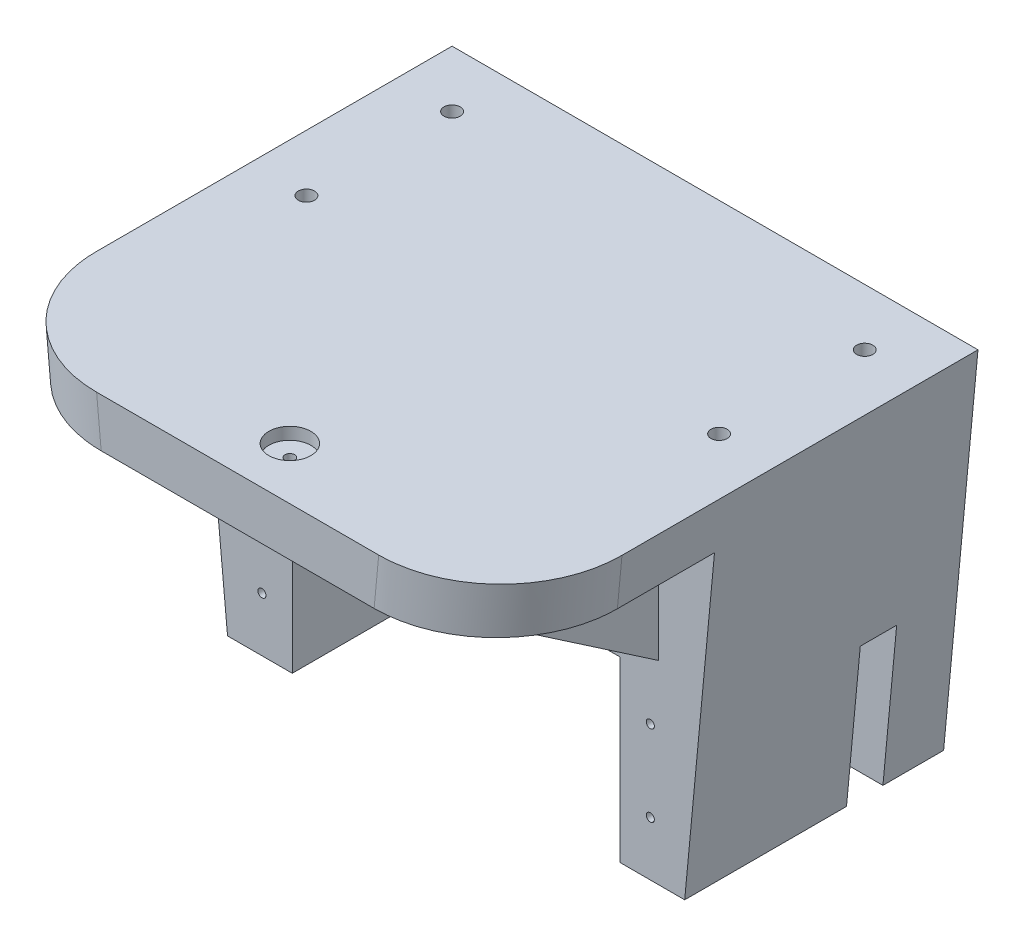
ISO-10303-21;
HEADER;
FILE_DESCRIPTION(('STEP AP214'),'2;1');
FILE_NAME('part.step','',(''),(''),'','','');
FILE_SCHEMA(('AUTOMOTIVE_DESIGN { 1 0 10303 214 1 1 1 1 }'));
ENDSEC;
DATA;
#1=APPLICATION_CONTEXT('core data for automotive mechanical design processes');
#2=APPLICATION_PROTOCOL_DEFINITION('international standard','automotive_design',2000,#1);
#3=PRODUCT_CONTEXT('',#1,'mechanical');
#4=PRODUCT('Part','Part','',(#3));
#5=PRODUCT_RELATED_PRODUCT_CATEGORY('part','',(#4));
#6=PRODUCT_DEFINITION_FORMATION('','',#4);
#7=PRODUCT_DEFINITION_CONTEXT('part definition',#1,'design');
#8=PRODUCT_DEFINITION('design','',#6,#7);
#9=PRODUCT_DEFINITION_SHAPE('','',#8);
#10=(LENGTH_UNIT() NAMED_UNIT(*) SI_UNIT(.MILLI.,.METRE.));
#11=(NAMED_UNIT(*) PLANE_ANGLE_UNIT() SI_UNIT($,.RADIAN.));
#12=(NAMED_UNIT(*) SI_UNIT($,.STERADIAN.) SOLID_ANGLE_UNIT());
#13=UNCERTAINTY_MEASURE_WITH_UNIT(LENGTH_MEASURE(1.E-05),#10,'distance_accuracy_value','');
#14=(GEOMETRIC_REPRESENTATION_CONTEXT(3) GLOBAL_UNCERTAINTY_ASSIGNED_CONTEXT((#13)) GLOBAL_UNIT_ASSIGNED_CONTEXT((#10,
#11,#12)) REPRESENTATION_CONTEXT('',''));
#15=CARTESIAN_POINT('',(0.,0.,0.));
#16=DIRECTION('',(0.,0.,1.));
#17=DIRECTION('',(1.,0.,0.));
#18=AXIS2_PLACEMENT_3D('',#15,#16,#17);
#19=CARTESIAN_POINT('',(0.,0.,30.));
#20=DIRECTION('',(0.,0.,-1.));
#21=DIRECTION('',(-1.,0.,0.));
#22=AXIS2_PLACEMENT_3D('',#19,#20,#21);
#23=PLANE('',#22);
#24=CARTESIAN_POINT('',(-24.,3.01948180668569,30.));
#25=DIRECTION('',(0.,0.,1.));
#26=DIRECTION('',(1.,0.,0.));
#27=AXIS2_PLACEMENT_3D('',#24,#25,#26);
#28=CIRCLE('',#27,0.499999999999999);
#29=CARTESIAN_POINT('',(-23.5,3.01948180668569,30.));
#30=VERTEX_POINT('',#29);
#31=EDGE_CURVE('E308',#30,#30,#28,.T.);
#32=ORIENTED_EDGE('',*,*,#31,.F.);
#33=EDGE_LOOP('',(#32));
#34=FACE_BOUND('',#33,.T.);
#35=CARTESIAN_POINT('',(24.,-6.98051819331431,30.));
#36=DIRECTION('',(0.,0.,1.));
#37=DIRECTION('',(1.,0.,0.));
#38=AXIS2_PLACEMENT_3D('',#35,#36,#37);
#39=CIRCLE('',#38,0.499999999999999);
#40=CARTESIAN_POINT('',(24.5,-6.98051819331431,30.));
#41=VERTEX_POINT('',#40);
#42=EDGE_CURVE('E296',#41,#41,#39,.T.);
#43=ORIENTED_EDGE('',*,*,#42,.F.);
#44=EDGE_LOOP('',(#43));
#45=FACE_BOUND('',#44,.T.);
#46=CARTESIAN_POINT('',(-24.,-6.98051819331431,30.));
#47=DIRECTION('',(0.,0.,1.));
#48=DIRECTION('',(1.,0.,0.));
#49=AXIS2_PLACEMENT_3D('',#46,#47,#48);
#50=CIRCLE('',#49,0.499999999999999);
#51=CARTESIAN_POINT('',(-23.5,-6.98051819331431,30.));
#52=VERTEX_POINT('',#51);
#53=EDGE_CURVE('E313',#52,#52,#50,.T.);
#54=ORIENTED_EDGE('',*,*,#53,.F.);
#55=EDGE_LOOP('',(#54));
#56=FACE_BOUND('',#55,.T.);
#57=CARTESIAN_POINT('',(24.,3.01948180668569,30.));
#58=DIRECTION('',(0.,0.,1.));
#59=DIRECTION('',(1.,0.,0.));
#60=AXIS2_PLACEMENT_3D('',#57,#58,#59);
#61=CIRCLE('',#60,0.499999999999999);
#62=CARTESIAN_POINT('',(24.5,3.01948180668569,30.));
#63=VERTEX_POINT('',#62);
#64=EDGE_CURVE('E304',#63,#63,#61,.T.);
#65=ORIENTED_EDGE('',*,*,#64,.F.);
#66=EDGE_LOOP('',(#65));
#67=FACE_BOUND('',#66,.T.);
#68=DIRECTION('',(0.,1.,0.));
#69=VECTOR('',#68,1.);
#70=CARTESIAN_POINT('',(-25.,25.3194818066857,30.));
#71=LINE('',#70,#69);
#72=CARTESIAN_POINT('',(-25.,10.3194818066857,30.));
#73=VERTEX_POINT('',#72);
#74=CARTESIAN_POINT('',(-25.,25.3194818066857,30.));
#75=VERTEX_POINT('',#74);
#76=EDGE_CURVE('E199',#73,#75,#71,.T.);
#77=ORIENTED_EDGE('',*,*,#76,.T.);
#78=DIRECTION('',(1.,0.,0.));
#79=VECTOR('',#78,1.);
#80=CARTESIAN_POINT('',(31.9333333333333,25.3194818066857,30.));
#81=LINE('',#80,#79);
#82=CARTESIAN_POINT('',(-31.9333333333333,25.3194818066857,30.));
#83=VERTEX_POINT('',#82);
#84=EDGE_CURVE('E211',#83,#75,#81,.T.);
#85=ORIENTED_EDGE('',*,*,#84,.F.);
#86=DIRECTION('',(0.0940260309196416,-0.995569739149146,0.));
#87=VECTOR('',#86,1.);
#88=CARTESIAN_POINT('',(-28.25,-13.6805181933143,30.));
#89=LINE('',#88,#87);
#90=CARTESIAN_POINT('',(-28.25,-13.6805181933143,30.));
#91=VERTEX_POINT('',#90);
#92=EDGE_CURVE('E375',#83,#91,#89,.T.);
#93=ORIENTED_EDGE('',*,*,#92,.T.);
#94=DIRECTION('',(1.,0.,0.));
#95=VECTOR('',#94,1.);
#96=CARTESIAN_POINT('',(-20.25,-13.6805181933143,30.));
#97=LINE('',#96,#95);
#98=CARTESIAN_POINT('',(-20.25,-13.6805181933143,30.));
#99=VERTEX_POINT('',#98);
#100=EDGE_CURVE('E378',#91,#99,#97,.T.);
#101=ORIENTED_EDGE('',*,*,#100,.T.);
#102=DIRECTION('',(0.,1.,0.));
#103=VECTOR('',#102,1.);
#104=CARTESIAN_POINT('',(-20.25,8.31948180668569,30.));
#105=LINE('',#104,#103);
#106=CARTESIAN_POINT('',(-20.25,8.31948180668569,30.));
#107=VERTEX_POINT('',#106);
#108=EDGE_CURVE('E382',#99,#107,#105,.T.);
#109=ORIENTED_EDGE('',*,*,#108,.T.);
#110=DIRECTION('',(1.,0.,0.));
#111=VECTOR('',#110,1.);
#112=CARTESIAN_POINT('',(20.25,8.31948180668569,30.));
#113=LINE('',#112,#111);
#114=CARTESIAN_POINT('',(20.25,8.31948180668569,30.));
#115=VERTEX_POINT('',#114);
#116=EDGE_CURVE('E385',#107,#115,#113,.T.);
#117=ORIENTED_EDGE('',*,*,#116,.T.);
#118=DIRECTION('',(0.,-1.,0.));
#119=VECTOR('',#118,1.);
#120=CARTESIAN_POINT('',(20.25,-13.6805181933143,30.));
#121=LINE('',#120,#119);
#122=CARTESIAN_POINT('',(20.25,-13.6805181933143,30.));
#123=VERTEX_POINT('',#122);
#124=EDGE_CURVE('E388',#115,#123,#121,.T.);
#125=ORIENTED_EDGE('',*,*,#124,.T.);
#126=DIRECTION('',(1.,0.,0.));
#127=VECTOR('',#126,1.);
#128=CARTESIAN_POINT('',(28.25,-13.6805181933143,30.));
#129=LINE('',#128,#127);
#130=CARTESIAN_POINT('',(28.25,-13.6805181933143,30.));
#131=VERTEX_POINT('',#130);
#132=EDGE_CURVE('E391',#123,#131,#129,.T.);
#133=ORIENTED_EDGE('',*,*,#132,.T.);
#134=DIRECTION('',(0.0940260309196416,0.995569739149146,0.));
#135=VECTOR('',#134,1.);
#136=CARTESIAN_POINT('',(32.5,31.3194818066857,30.));
#137=LINE('',#136,#135);
#138=CARTESIAN_POINT('',(31.9333333333333,25.3194818066857,30.));
#139=VERTEX_POINT('',#138);
#140=EDGE_CURVE('E394',#131,#139,#137,.T.);
#141=ORIENTED_EDGE('',*,*,#140,.T.);
#142=CARTESIAN_POINT('',(25.,25.3194818066857,30.));
#143=VERTEX_POINT('',#142);
#144=EDGE_CURVE('E224',#143,#139,#81,.T.);
#145=ORIENTED_EDGE('',*,*,#144,.F.);
#146=DIRECTION('',(0.,1.,0.));
#147=VECTOR('',#146,1.);
#148=CARTESIAN_POINT('',(25.,25.3194818066857,30.));
#149=LINE('',#148,#147);
#150=CARTESIAN_POINT('',(25.,10.3194818066857,30.));
#151=VERTEX_POINT('',#150);
#152=EDGE_CURVE('E247',#151,#143,#149,.T.);
#153=ORIENTED_EDGE('',*,*,#152,.F.);
#154=DIRECTION('',(-1.,0.,0.));
#155=VECTOR('',#154,1.);
#156=CARTESIAN_POINT('',(25.,10.3194818066857,30.));
#157=LINE('',#156,#155);
#158=CARTESIAN_POINT('',(20.,10.3194818066857,30.));
#159=VERTEX_POINT('',#158);
#160=EDGE_CURVE('E240',#151,#159,#157,.T.);
#161=ORIENTED_EDGE('',*,*,#160,.T.);
#162=DIRECTION('',(0.,1.,0.));
#163=VECTOR('',#162,1.);
#164=CARTESIAN_POINT('',(20.,25.3194818066857,30.));
#165=LINE('',#164,#163);
#166=CARTESIAN_POINT('',(20.,25.3194818066857,30.));
#167=VERTEX_POINT('',#166);
#168=EDGE_CURVE('E1089',#159,#167,#165,.T.);
#169=ORIENTED_EDGE('',*,*,#168,.T.);
#170=CARTESIAN_POINT('',(-20.,25.3194818066857,30.));
#171=VERTEX_POINT('',#170);
#172=EDGE_CURVE('E222',#171,#167,#81,.T.);
#173=ORIENTED_EDGE('',*,*,#172,.F.);
#174=DIRECTION('',(0.,1.,0.));
#175=VECTOR('',#174,1.);
#176=CARTESIAN_POINT('',(-20.,25.3194818066857,30.));
#177=LINE('',#176,#175);
#178=CARTESIAN_POINT('',(-20.,10.3194818066857,30.));
#179=VERTEX_POINT('',#178);
#180=EDGE_CURVE('E1065',#179,#171,#177,.T.);
#181=ORIENTED_EDGE('',*,*,#180,.F.);
#182=DIRECTION('',(1.,0.,0.));
#183=VECTOR('',#182,1.);
#184=CARTESIAN_POINT('',(-25.,10.3194818066857,30.));
#185=LINE('',#184,#183);
#186=EDGE_CURVE('E214',#73,#179,#185,.T.);
#187=ORIENTED_EDGE('',*,*,#186,.F.);
#188=EDGE_LOOP('',(#77,#85,#93,#101,#109,#117,#125,#133,#141,#145,#153,#161,#169,#173,#181,#187));
#189=FACE_BOUND('',#188,.T.);
#190=ADVANCED_FACE('F44',(#34,#45,#56,#67,#189),#23,.F.);
#191=CARTESIAN_POINT('',(31.9333333333333,25.3194818066857,57.));
#192=DIRECTION('',(0.,1.,0.));
#193=DIRECTION('',(-1.,0.,0.));
#194=AXIS2_PLACEMENT_3D('',#191,#192,#193);
#195=PLANE('',#194);
#196=CARTESIAN_POINT('',(0.,25.3194818066857,50.55));
#197=DIRECTION('',(0.,1.,0.));
#198=DIRECTION('',(-1.,0.,0.));
#199=AXIS2_PLACEMENT_3D('',#196,#197,#198);
#200=CIRCLE('',#199,1.1);
#201=CARTESIAN_POINT('',(-1.1,25.3194818066857,50.55));
#202=VERTEX_POINT('',#201);
#203=EDGE_CURVE('E54',#202,#202,#200,.T.);
#204=ORIENTED_EDGE('',*,*,#203,.T.);
#205=EDGE_LOOP('',(#204));
#206=FACE_BOUND('',#205,.T.);
#207=DIRECTION('',(1.,0.,0.));
#208=VECTOR('',#207,1.);
#209=CARTESIAN_POINT('',(31.9333333333333,25.3194818066857,57.));
#210=LINE('',#209,#208);
#211=CARTESIAN_POINT('',(-16.8665837022933,25.3194818066857,57.));
#212=VERTEX_POINT('',#211);
#213=CARTESIAN_POINT('',(16.8665837022933,25.3194818066857,57.));
#214=VERTEX_POINT('',#213);
#215=EDGE_CURVE('E221',#212,#214,#210,.T.);
#216=ORIENTED_EDGE('',*,*,#215,.F.);
#217=CARTESIAN_POINT('',(-16.8665837022933,25.3194818066857,42.));
#218=DIRECTION('',(0.,1.,0.));
#219=DIRECTION('',(1.,0.,0.));
#220=AXIS2_PLACEMENT_3D('',#217,#218,#219);
#221=ELLIPSE('',#220,15.06674963104,15.);
#222=CARTESIAN_POINT('',(-31.9333333333333,25.3194818066857,42.));
#223=VERTEX_POINT('',#222);
#224=EDGE_CURVE('E459',#212,#223,#221,.F.);
#225=ORIENTED_EDGE('',*,*,#224,.T.);
#226=DIRECTION('',(0.,0.,-1.));
#227=VECTOR('',#226,1.);
#228=CARTESIAN_POINT('',(-31.9333333333333,25.3194818066857,57.));
#229=LINE('',#228,#227);
#230=EDGE_CURVE('E219',#223,#83,#229,.T.);
#231=ORIENTED_EDGE('',*,*,#230,.T.);
#232=ORIENTED_EDGE('',*,*,#84,.T.);
#233=DIRECTION('',(0.,0.,1.));
#234=VECTOR('',#233,1.);
#235=CARTESIAN_POINT('',(-25.,25.3194818066857,52.));
#236=LINE('',#235,#234);
#237=CARTESIAN_POINT('',(-25.,25.3194818066857,52.));
#238=VERTEX_POINT('',#237);
#239=EDGE_CURVE('E196',#75,#238,#236,.T.);
#240=ORIENTED_EDGE('',*,*,#239,.T.);
#241=DIRECTION('',(1.,0.,0.));
#242=VECTOR('',#241,1.);
#243=CARTESIAN_POINT('',(-25.,25.3194818066857,52.));
#244=LINE('',#243,#242);
#245=CARTESIAN_POINT('',(-20.,25.3194818066857,52.));
#246=VERTEX_POINT('',#245);
#247=EDGE_CURVE('E1072',#238,#246,#244,.T.);
#248=ORIENTED_EDGE('',*,*,#247,.T.);
#249=DIRECTION('',(0.,0.,1.));
#250=VECTOR('',#249,1.);
#251=CARTESIAN_POINT('',(-20.,25.3194818066857,52.));
#252=LINE('',#251,#250);
#253=EDGE_CURVE('E1060',#171,#246,#252,.T.);
#254=ORIENTED_EDGE('',*,*,#253,.F.);
#255=ORIENTED_EDGE('',*,*,#172,.T.);
#256=DIRECTION('',(0.,0.,1.));
#257=VECTOR('',#256,1.);
#258=CARTESIAN_POINT('',(20.,25.3194818066857,52.));
#259=LINE('',#258,#257);
#260=CARTESIAN_POINT('',(20.,25.3194818066857,52.));
#261=VERTEX_POINT('',#260);
#262=EDGE_CURVE('E1083',#167,#261,#259,.T.);
#263=ORIENTED_EDGE('',*,*,#262,.T.);
#264=DIRECTION('',(-1.,0.,0.));
#265=VECTOR('',#264,1.);
#266=CARTESIAN_POINT('',(25.,25.3194818066857,52.));
#267=LINE('',#266,#265);
#268=CARTESIAN_POINT('',(25.,25.3194818066857,52.));
#269=VERTEX_POINT('',#268);
#270=EDGE_CURVE('E234',#269,#261,#267,.T.);
#271=ORIENTED_EDGE('',*,*,#270,.F.);
#272=DIRECTION('',(0.,0.,1.));
#273=VECTOR('',#272,1.);
#274=CARTESIAN_POINT('',(25.,25.3194818066857,52.));
#275=LINE('',#274,#273);
#276=EDGE_CURVE('E1084',#143,#269,#275,.T.);
#277=ORIENTED_EDGE('',*,*,#276,.F.);
#278=ORIENTED_EDGE('',*,*,#144,.T.);
#279=DIRECTION('',(0.,0.,-1.));
#280=VECTOR('',#279,1.);
#281=CARTESIAN_POINT('',(31.9333333333333,25.3194818066857,57.));
#282=LINE('',#281,#280);
#283=CARTESIAN_POINT('',(31.9333333333333,25.3194818066857,42.));
#284=VERTEX_POINT('',#283);
#285=EDGE_CURVE('E252',#284,#139,#282,.T.);
#286=ORIENTED_EDGE('',*,*,#285,.F.);
#287=CARTESIAN_POINT('',(16.8665837022933,25.3194818066857,42.));
#288=DIRECTION('',(0.,1.,0.));
#289=DIRECTION('',(1.,0.,0.));
#290=AXIS2_PLACEMENT_3D('',#287,#288,#289);
#291=ELLIPSE('',#290,15.06674963104,15.);
#292=EDGE_CURVE('E456',#284,#214,#291,.F.);
#293=ORIENTED_EDGE('',*,*,#292,.T.);
#294=EDGE_LOOP('',(#216,#225,#231,#232,#240,#248,#254,#255,#263,#271,#277,#278,#286,#293));
#295=FACE_BOUND('',#294,.T.);
#296=ADVANCED_FACE('F218',(#206,#295),#195,.F.);
#297=CARTESIAN_POINT('',(28.25,-13.6805181933143,30.));
#298=DIRECTION('',(0.,1.,0.));
#299=DIRECTION('',(0.,0.,1.));
#300=AXIS2_PLACEMENT_3D('',#297,#298,#299);
#301=PLANE('',#300);
#302=DIRECTION('',(0.,0.,-1.));
#303=VECTOR('',#302,1.);
#304=CARTESIAN_POINT('',(20.25,-13.6805181933143,30.));
#305=LINE('',#304,#303);
#306=CARTESIAN_POINT('',(20.25,-13.6805181933143,10.));
#307=VERTEX_POINT('',#306);
#308=EDGE_CURVE('E419',#123,#307,#305,.T.);
#309=ORIENTED_EDGE('',*,*,#308,.T.);
#310=DIRECTION('',(1.,0.,0.));
#311=VECTOR('',#310,1.);
#312=CARTESIAN_POINT('',(11.5,-13.6805181933143,10.));
#313=LINE('',#312,#311);
#314=CARTESIAN_POINT('',(28.25,-13.6805181933143,10.));
#315=VERTEX_POINT('',#314);
#316=EDGE_CURVE('E348',#307,#315,#313,.T.);
#317=ORIENTED_EDGE('',*,*,#316,.T.);
#318=DIRECTION('',(0.,0.,-1.));
#319=VECTOR('',#318,1.);
#320=CARTESIAN_POINT('',(28.25,-13.6805181933143,30.));
#321=LINE('',#320,#319);
#322=EDGE_CURVE('E414',#131,#315,#321,.T.);
#323=ORIENTED_EDGE('',*,*,#322,.F.);
#324=ORIENTED_EDGE('',*,*,#132,.F.);
#325=EDGE_LOOP('',(#309,#317,#323,#324));
#326=FACE_BOUND('',#325,.T.);
#327=ADVANCED_FACE('F492',(#326),#301,.F.);
#328=CARTESIAN_POINT('',(-28.25,-13.6805181933143,30.));
#329=DIRECTION('',(0.995569739149146,0.0940260309196416,0.));
#330=DIRECTION('',(-0.0940260309196416,0.995569739149146,0.));
#331=AXIS2_PLACEMENT_3D('',#328,#329,#330);
#332=PLANE('',#331);
#333=ORIENTED_EDGE('',*,*,#230,.F.);
#334=DIRECTION('',(0.0940260309196416,-0.995569739149146,0.));
#335=VECTOR('',#334,1.);
#336=CARTESIAN_POINT('',(-28.25,-13.6805181933143,42.));
#337=LINE('',#336,#335);
#338=CARTESIAN_POINT('',(-32.5,31.3194818066857,42.));
#339=VERTEX_POINT('',#338);
#340=EDGE_CURVE('E69',#223,#339,#337,.F.);
#341=ORIENTED_EDGE('',*,*,#340,.T.);
#342=DIRECTION('',(0.,0.,-1.));
#343=VECTOR('',#342,1.);
#344=CARTESIAN_POINT('',(-32.5,31.3194818066857,30.));
#345=LINE('',#344,#343);
#346=CARTESIAN_POINT('',(-32.5,31.3194818066857,-2.));
#347=VERTEX_POINT('',#346);
#348=EDGE_CURVE('E397',#339,#347,#345,.T.);
#349=ORIENTED_EDGE('',*,*,#348,.T.);
#350=DIRECTION('',(-0.0940260309196416,0.995569739149146,0.));
#351=VECTOR('',#350,1.);
#352=CARTESIAN_POINT('',(-32.5,31.3194818066857,-2.));
#353=LINE('',#352,#351);
#354=CARTESIAN_POINT('',(-28.25,-13.6805181933143,-2.));
#355=VERTEX_POINT('',#354);
#356=EDGE_CURVE('E336',#355,#347,#353,.T.);
#357=ORIENTED_EDGE('',*,*,#356,.F.);
#358=DIRECTION('',(0.,0.,-1.));
#359=VECTOR('',#358,1.);
#360=CARTESIAN_POINT('',(-28.25,-13.6805181933143,30.));
#361=LINE('',#360,#359);
#362=EDGE_CURVE('E435',#91,#355,#361,.T.);
#363=ORIENTED_EDGE('',*,*,#362,.F.);
#364=ORIENTED_EDGE('',*,*,#92,.F.);
#365=EDGE_LOOP('',(#333,#341,#349,#357,#363,#364));
#366=FACE_BOUND('',#365,.T.);
#367=ADVANCED_FACE('F523',(#366),#332,.F.);
#368=CARTESIAN_POINT('',(-20.25,8.31948180668569,30.));
#369=DIRECTION('',(-1.,0.,0.));
#370=DIRECTION('',(0.,0.,1.));
#371=AXIS2_PLACEMENT_3D('',#368,#369,#370);
#372=PLANE('',#371);
#373=DIRECTION('',(0.,1.,0.));
#374=VECTOR('',#373,1.);
#375=CARTESIAN_POINT('',(-20.25,8.31948180668569,0.));
#376=LINE('',#375,#374);
#377=CARTESIAN_POINT('',(-20.25,-13.6805181933143,0.));
#378=VERTEX_POINT('',#377);
#379=CARTESIAN_POINT('',(-20.25,8.31948180668569,0.));
#380=VERTEX_POINT('',#379);
#381=EDGE_CURVE('E374',#378,#380,#376,.T.);
#382=ORIENTED_EDGE('',*,*,#381,.T.);
#383=DIRECTION('',(0.,0.,-1.));
#384=VECTOR('',#383,1.);
#385=CARTESIAN_POINT('',(-20.25,8.31948180668569,30.));
#386=LINE('',#385,#384);
#387=EDGE_CURVE('E427',#107,#380,#386,.T.);
#388=ORIENTED_EDGE('',*,*,#387,.F.);
#389=ORIENTED_EDGE('',*,*,#108,.F.);
#390=DIRECTION('',(0.,0.,-1.));
#391=VECTOR('',#390,1.);
#392=CARTESIAN_POINT('',(-20.25,-13.6805181933143,30.));
#393=LINE('',#392,#391);
#394=EDGE_CURVE('E431',#99,#378,#393,.T.);
#395=ORIENTED_EDGE('',*,*,#394,.T.);
#396=EDGE_LOOP('',(#382,#388,#389,#395));
#397=FACE_BOUND('',#396,.T.);
#398=ADVANCED_FACE('F519',(#397),#372,.F.);
#399=CARTESIAN_POINT('',(20.25,8.31948180668569,30.));
#400=DIRECTION('',(0.,1.,0.));
#401=DIRECTION('',(0.,0.,1.));
#402=AXIS2_PLACEMENT_3D('',#399,#400,#401);
#403=PLANE('',#402);
#404=DIRECTION('',(1.,0.,0.));
#405=VECTOR('',#404,1.);
#406=CARTESIAN_POINT('',(20.25,8.31948180668569,0.));
#407=LINE('',#406,#405);
#408=CARTESIAN_POINT('',(20.25,8.31948180668569,0.));
#409=VERTEX_POINT('',#408);
#410=EDGE_CURVE('E401',#380,#409,#407,.T.);
#411=ORIENTED_EDGE('',*,*,#410,.T.);
#412=DIRECTION('',(0.,0.,-1.));
#413=VECTOR('',#412,1.);
#414=CARTESIAN_POINT('',(20.25,8.31948180668569,30.));
#415=LINE('',#414,#413);
#416=EDGE_CURVE('E423',#115,#409,#415,.T.);
#417=ORIENTED_EDGE('',*,*,#416,.F.);
#418=ORIENTED_EDGE('',*,*,#116,.F.);
#419=ORIENTED_EDGE('',*,*,#387,.T.);
#420=EDGE_LOOP('',(#411,#417,#418,#419));
#421=FACE_BOUND('',#420,.T.);
#422=ADVANCED_FACE('F515',(#421),#403,.F.);
#423=CARTESIAN_POINT('',(20.25,-13.6805181933143,30.));
#424=DIRECTION('',(1.,0.,0.));
#425=DIRECTION('',(0.,0.,-1.));
#426=AXIS2_PLACEMENT_3D('',#423,#424,#425);
#427=PLANE('',#426);
#428=DIRECTION('',(0.,0.,1.));
#429=VECTOR('',#428,1.);
#430=CARTESIAN_POINT('',(20.25,4.31948180668569,30.));
#431=LINE('',#430,#429);
#432=CARTESIAN_POINT('',(20.25,4.31948180668569,5.5));
#433=VERTEX_POINT('',#432);
#434=CARTESIAN_POINT('',(20.25,4.31948180668569,10.));
#435=VERTEX_POINT('',#434);
#436=EDGE_CURVE('E366',#433,#435,#431,.T.);
#437=ORIENTED_EDGE('',*,*,#436,.T.);
#438=DIRECTION('',(0.,-1.,0.));
#439=VECTOR('',#438,1.);
#440=CARTESIAN_POINT('',(20.25,-13.6805181933143,10.));
#441=LINE('',#440,#439);
#442=EDGE_CURVE('E370',#435,#307,#441,.T.);
#443=ORIENTED_EDGE('',*,*,#442,.T.);
#444=ORIENTED_EDGE('',*,*,#308,.F.);
#445=ORIENTED_EDGE('',*,*,#124,.F.);
#446=ORIENTED_EDGE('',*,*,#416,.T.);
#447=DIRECTION('',(0.,-1.,0.));
#448=VECTOR('',#447,1.);
#449=CARTESIAN_POINT('',(20.25,-13.6805181933143,0.));
#450=LINE('',#449,#448);
#451=CARTESIAN_POINT('',(20.25,-13.6805181933143,0.));
#452=VERTEX_POINT('',#451);
#453=EDGE_CURVE('E379',#409,#452,#450,.T.);
#454=ORIENTED_EDGE('',*,*,#453,.T.);
#455=CARTESIAN_POINT('',(20.25,-13.6805181933143,5.5));
#456=VERTEX_POINT('',#455);
#457=EDGE_CURVE('E418',#456,#452,#305,.T.);
#458=ORIENTED_EDGE('',*,*,#457,.F.);
#459=DIRECTION('',(0.,1.,0.));
#460=VECTOR('',#459,1.);
#461=CARTESIAN_POINT('',(20.25,-13.6805181933143,5.5));
#462=LINE('',#461,#460);
#463=EDGE_CURVE('E352',#456,#433,#462,.T.);
#464=ORIENTED_EDGE('',*,*,#463,.T.);
#465=EDGE_LOOP('',(#437,#443,#444,#445,#446,#454,#458,#464));
#466=FACE_BOUND('',#465,.T.);
#467=ADVANCED_FACE('F511',(#466),#427,.F.);
#468=CARTESIAN_POINT('',(28.25,-13.6805181933143,5.49999999999999));
#469=VERTEX_POINT('',#468);
#470=CARTESIAN_POINT('',(28.25,-13.6805181933143,-2.));
#471=VERTEX_POINT('',#470);
#472=EDGE_CURVE('E413',#469,#471,#321,.T.);
#473=ORIENTED_EDGE('',*,*,#472,.F.);
#474=DIRECTION('',(1.,0.,0.));
#475=VECTOR('',#474,1.);
#476=CARTESIAN_POINT('',(11.5,-13.6805181933143,5.5));
#477=LINE('',#476,#475);
#478=EDGE_CURVE('E344',#456,#469,#477,.T.);
#479=ORIENTED_EDGE('',*,*,#478,.F.);
#480=ORIENTED_EDGE('',*,*,#457,.T.);
#481=DIRECTION('',(-1.,0.,0.));
#482=VECTOR('',#481,1.);
#483=CARTESIAN_POINT('',(-28.25,-13.6805181933143,0.));
#484=LINE('',#483,#482);
#485=EDGE_CURVE('E324',#452,#378,#484,.T.);
#486=ORIENTED_EDGE('',*,*,#485,.T.);
#487=ORIENTED_EDGE('',*,*,#394,.F.);
#488=ORIENTED_EDGE('',*,*,#100,.F.);
#489=ORIENTED_EDGE('',*,*,#362,.T.);
#490=DIRECTION('',(-1.,0.,0.));
#491=VECTOR('',#490,1.);
#492=CARTESIAN_POINT('',(20.25,-13.6805181933143,-2.));
#493=LINE('',#492,#491);
#494=EDGE_CURVE('E332',#471,#355,#493,.T.);
#495=ORIENTED_EDGE('',*,*,#494,.F.);
#496=EDGE_LOOP('',(#473,#479,#480,#486,#487,#488,#489,#495));
#497=FACE_BOUND('',#496,.T.);
#498=ADVANCED_FACE('F508',(#497),#301,.F.);
#499=CARTESIAN_POINT('',(32.5,31.3194818066857,30.));
#500=DIRECTION('',(-0.995569739149146,0.0940260309196416,0.));
#501=DIRECTION('',(-0.0940260309196416,-0.995569739149146,0.));
#502=AXIS2_PLACEMENT_3D('',#499,#500,#501);
#503=PLANE('',#502);
#504=DIRECTION('',(0.,0.,-1.));
#505=VECTOR('',#504,1.);
#506=CARTESIAN_POINT('',(32.5,31.3194818066857,30.));
#507=LINE('',#506,#505);
#508=CARTESIAN_POINT('',(32.5,31.3194818066857,42.));
#509=VERTEX_POINT('',#508);
#510=CARTESIAN_POINT('',(32.5,31.3194818066857,-2.));
#511=VERTEX_POINT('',#510);
#512=EDGE_CURVE('E410',#509,#511,#507,.T.);
#513=ORIENTED_EDGE('',*,*,#512,.F.);
#514=DIRECTION('',(0.0940260309196416,0.995569739149146,0.));
#515=VECTOR('',#514,1.);
#516=CARTESIAN_POINT('',(32.5,31.3194818066857,42.));
#517=LINE('',#516,#515);
#518=EDGE_CURVE('E469',#509,#284,#517,.F.);
#519=ORIENTED_EDGE('',*,*,#518,.T.);
#520=ORIENTED_EDGE('',*,*,#285,.T.);
#521=ORIENTED_EDGE('',*,*,#140,.F.);
#522=ORIENTED_EDGE('',*,*,#322,.T.);
#523=DIRECTION('',(0.0940260309196416,0.995569739149146,0.));
#524=VECTOR('',#523,1.);
#525=CARTESIAN_POINT('',(32.5,31.3194818066857,10.));
#526=LINE('',#525,#524);
#527=CARTESIAN_POINT('',(29.95,4.31948180668569,10.));
#528=VERTEX_POINT('',#527);
#529=EDGE_CURVE('E446',#315,#528,#526,.T.);
#530=ORIENTED_EDGE('',*,*,#529,.T.);
#531=DIRECTION('',(0.,0.,-1.));
#532=VECTOR('',#531,1.);
#533=CARTESIAN_POINT('',(29.95,4.31948180668569,30.));
#534=LINE('',#533,#532);
#535=CARTESIAN_POINT('',(29.95,4.31948180668569,5.5));
#536=VERTEX_POINT('',#535);
#537=EDGE_CURVE('E442',#528,#536,#534,.T.);
#538=ORIENTED_EDGE('',*,*,#537,.T.);
#539=DIRECTION('',(-0.0940260309196416,-0.995569739149146,0.));
#540=VECTOR('',#539,1.);
#541=CARTESIAN_POINT('',(32.5,31.3194818066857,5.49999999999999));
#542=LINE('',#541,#540);
#543=EDGE_CURVE('E438',#536,#469,#542,.T.);
#544=ORIENTED_EDGE('',*,*,#543,.T.);
#545=ORIENTED_EDGE('',*,*,#472,.T.);
#546=DIRECTION('',(-0.0940260309196416,-0.995569739149146,0.));
#547=VECTOR('',#546,1.);
#548=CARTESIAN_POINT('',(28.25,-13.6805181933143,-2.));
#549=LINE('',#548,#547);
#550=EDGE_CURVE('E328',#511,#471,#549,.T.);
#551=ORIENTED_EDGE('',*,*,#550,.F.);
#552=EDGE_LOOP('',(#513,#519,#520,#521,#522,#530,#538,#544,#545,#551));
#553=FACE_BOUND('',#552,.T.);
#554=ADVANCED_FACE('F504',(#553),#503,.F.);
#555=CARTESIAN_POINT('',(-32.5,31.3194818066857,30.));
#556=DIRECTION('',(0.,-1.,0.));
#557=DIRECTION('',(0.,0.,-1.));
#558=AXIS2_PLACEMENT_3D('',#555,#556,#557);
#559=PLANE('',#558);
#560=CARTESIAN_POINT('',(0.,31.3194818066857,50.55));
#561=DIRECTION('',(0.,1.,0.));
#562=DIRECTION('',(0.,0.,1.));
#563=AXIS2_PLACEMENT_3D('',#560,#561,#562);
#564=CIRCLE('',#563,2.6);
#565=CARTESIAN_POINT('',(0.,31.3194818066857,53.15));
#566=VERTEX_POINT('',#565);
#567=EDGE_CURVE('E1061',#566,#566,#564,.T.);
#568=ORIENTED_EDGE('',*,*,#567,.F.);
#569=EDGE_LOOP('',(#568));
#570=FACE_BOUND('',#569,.T.);
#571=CARTESIAN_POINT('',(-25.5,31.3194818066857,23.));
#572=DIRECTION('',(0.,1.,0.));
#573=DIRECTION('',(0.,0.,1.));
#574=AXIS2_PLACEMENT_3D('',#571,#572,#573);
#575=CIRCLE('',#574,1.);
#576=CARTESIAN_POINT('',(-25.5,31.3194818066857,24.));
#577=VERTEX_POINT('',#576);
#578=EDGE_CURVE('E272',#577,#577,#575,.T.);
#579=ORIENTED_EDGE('',*,*,#578,.F.);
#580=EDGE_LOOP('',(#579));
#581=FACE_BOUND('',#580,.T.);
#582=CARTESIAN_POINT('',(25.5,31.3194818066857,5.));
#583=DIRECTION('',(0.,1.,0.));
#584=DIRECTION('',(0.,0.,1.));
#585=AXIS2_PLACEMENT_3D('',#582,#583,#584);
#586=CIRCLE('',#585,1.);
#587=CARTESIAN_POINT('',(25.5,31.3194818066857,6.));
#588=VERTEX_POINT('',#587);
#589=EDGE_CURVE('E281',#588,#588,#586,.T.);
#590=ORIENTED_EDGE('',*,*,#589,.F.);
#591=EDGE_LOOP('',(#590));
#592=FACE_BOUND('',#591,.T.);
#593=CARTESIAN_POINT('',(25.5,31.3194818066857,23.));
#594=DIRECTION('',(0.,1.,0.));
#595=DIRECTION('',(0.,0.,1.));
#596=AXIS2_PLACEMENT_3D('',#593,#594,#595);
#597=CIRCLE('',#596,1.);
#598=CARTESIAN_POINT('',(25.5,31.3194818066857,24.));
#599=VERTEX_POINT('',#598);
#600=EDGE_CURVE('E264',#599,#599,#597,.T.);
#601=ORIENTED_EDGE('',*,*,#600,.F.);
#602=EDGE_LOOP('',(#601));
#603=FACE_BOUND('',#602,.T.);
#604=CARTESIAN_POINT('',(-25.5,31.3194818066857,5.));
#605=DIRECTION('',(0.,1.,0.));
#606=DIRECTION('',(0.,0.,1.));
#607=AXIS2_PLACEMENT_3D('',#604,#605,#606);
#608=CIRCLE('',#607,1.);
#609=CARTESIAN_POINT('',(-25.5,31.3194818066857,6.));
#610=VERTEX_POINT('',#609);
#611=EDGE_CURVE('E276',#610,#610,#608,.T.);
#612=ORIENTED_EDGE('',*,*,#611,.F.);
#613=EDGE_LOOP('',(#612));
#614=FACE_BOUND('',#613,.T.);
#615=ORIENTED_EDGE('',*,*,#348,.F.);
#616=CARTESIAN_POINT('',(-17.43325036896,31.3194818066857,42.));
#617=DIRECTION('',(0.,-1.,0.));
#618=DIRECTION('',(1.,0.,0.));
#619=AXIS2_PLACEMENT_3D('',#616,#617,#618);
#620=ELLIPSE('',#619,15.06674963104,15.);
#621=CARTESIAN_POINT('',(-17.43325036896,31.3194818066857,57.));
#622=VERTEX_POINT('',#621);
#623=EDGE_CURVE('E466',#339,#622,#620,.F.);
#624=ORIENTED_EDGE('',*,*,#623,.T.);
#625=DIRECTION('',(-1.,0.,0.));
#626=VECTOR('',#625,1.);
#627=CARTESIAN_POINT('',(-32.5,31.3194818066857,57.));
#628=LINE('',#627,#626);
#629=CARTESIAN_POINT('',(17.43325036896,31.3194818066857,57.));
#630=VERTEX_POINT('',#629);
#631=EDGE_CURVE('E228',#630,#622,#628,.T.);
#632=ORIENTED_EDGE('',*,*,#631,.F.);
#633=CARTESIAN_POINT('',(17.43325036896,31.3194818066857,42.));
#634=DIRECTION('',(0.,-1.,0.));
#635=DIRECTION('',(1.,0.,0.));
#636=AXIS2_PLACEMENT_3D('',#633,#634,#635);
#637=ELLIPSE('',#636,15.06674963104,15.);
#638=EDGE_CURVE('E61',#630,#509,#637,.F.);
#639=ORIENTED_EDGE('',*,*,#638,.T.);
#640=ORIENTED_EDGE('',*,*,#512,.T.);
#641=DIRECTION('',(1.,0.,0.));
#642=VECTOR('',#641,1.);
#643=CARTESIAN_POINT('',(32.5,31.3194818066857,-2.));
#644=LINE('',#643,#642);
#645=EDGE_CURVE('E340',#347,#511,#644,.T.);
#646=ORIENTED_EDGE('',*,*,#645,.F.);
#647=EDGE_LOOP('',(#615,#624,#632,#639,#640,#646));
#648=FACE_BOUND('',#647,.T.);
#649=ADVANCED_FACE('F500',(#570,#581,#592,#603,#614,#648),#559,.F.);
#650=CARTESIAN_POINT('',(11.5,-13.6805181933143,10.));
#651=DIRECTION('',(0.,0.,1.));
#652=DIRECTION('',(1.,0.,0.));
#653=AXIS2_PLACEMENT_3D('',#650,#651,#652);
#654=PLANE('',#653);
#655=DIRECTION('',(1.,0.,0.));
#656=VECTOR('',#655,1.);
#657=CARTESIAN_POINT('',(11.5,4.31948180668569,10.));
#658=LINE('',#657,#656);
#659=EDGE_CURVE('E353',#435,#528,#658,.T.);
#660=ORIENTED_EDGE('',*,*,#659,.T.);
#661=ORIENTED_EDGE('',*,*,#529,.F.);
#662=ORIENTED_EDGE('',*,*,#316,.F.);
#663=ORIENTED_EDGE('',*,*,#442,.F.);
#664=EDGE_LOOP('',(#660,#661,#662,#663));
#665=FACE_BOUND('',#664,.T.);
#666=ADVANCED_FACE('F503',(#665),#654,.F.);
#667=CARTESIAN_POINT('',(11.5,4.31948180668569,10.));
#668=DIRECTION('',(0.,1.,0.));
#669=DIRECTION('',(0.,0.,1.));
#670=AXIS2_PLACEMENT_3D('',#667,#668,#669);
#671=PLANE('',#670);
#672=DIRECTION('',(1.,0.,0.));
#673=VECTOR('',#672,1.);
#674=CARTESIAN_POINT('',(11.5,4.31948180668569,5.5));
#675=LINE('',#674,#673);
#676=EDGE_CURVE('E357',#433,#536,#675,.T.);
#677=ORIENTED_EDGE('',*,*,#676,.T.);
#678=ORIENTED_EDGE('',*,*,#537,.F.);
#679=ORIENTED_EDGE('',*,*,#659,.F.);
#680=ORIENTED_EDGE('',*,*,#436,.F.);
#681=EDGE_LOOP('',(#677,#678,#679,#680));
#682=FACE_BOUND('',#681,.T.);
#683=ADVANCED_FACE('F565',(#682),#671,.F.);
#684=CARTESIAN_POINT('',(11.5,4.31948180668569,5.5));
#685=DIRECTION('',(0.,0.,-1.));
#686=DIRECTION('',(0.,1.,0.));
#687=AXIS2_PLACEMENT_3D('',#684,#685,#686);
#688=PLANE('',#687);
#689=ORIENTED_EDGE('',*,*,#478,.T.);
#690=ORIENTED_EDGE('',*,*,#543,.F.);
#691=ORIENTED_EDGE('',*,*,#676,.F.);
#692=ORIENTED_EDGE('',*,*,#463,.F.);
#693=EDGE_LOOP('',(#689,#690,#691,#692));
#694=FACE_BOUND('',#693,.T.);
#695=ADVANCED_FACE('F498',(#694),#688,.F.);
#696=CARTESIAN_POINT('',(0.,0.,0.));
#697=DIRECTION('',(0.,0.,1.));
#698=DIRECTION('',(1.,0.,0.));
#699=AXIS2_PLACEMENT_3D('',#696,#697,#698);
#700=PLANE('',#699);
#701=ORIENTED_EDGE('',*,*,#453,.F.);
#702=ORIENTED_EDGE('',*,*,#410,.F.);
#703=ORIENTED_EDGE('',*,*,#381,.F.);
#704=ORIENTED_EDGE('',*,*,#485,.F.);
#705=EDGE_LOOP('',(#701,#702,#703,#704));
#706=FACE_BOUND('',#705,.T.);
#707=ADVANCED_FACE('F578',(#706),#700,.T.);
#708=CARTESIAN_POINT('',(0.,0.,-2.));
#709=DIRECTION('',(0.,0.,1.));
#710=DIRECTION('',(1.,0.,0.));
#711=AXIS2_PLACEMENT_3D('',#708,#709,#710);
#712=PLANE('',#711);
#713=ORIENTED_EDGE('',*,*,#550,.T.);
#714=ORIENTED_EDGE('',*,*,#494,.T.);
#715=ORIENTED_EDGE('',*,*,#356,.T.);
#716=ORIENTED_EDGE('',*,*,#645,.T.);
#717=EDGE_LOOP('',(#713,#714,#715,#716));
#718=FACE_BOUND('',#717,.T.);
#719=ADVANCED_FACE('F574',(#718),#712,.F.);
#720=CARTESIAN_POINT('',(-24.,3.01948180668569,20.));
#721=DIRECTION('',(0.,0.,1.));
#722=DIRECTION('',(1.,0.,0.));
#723=AXIS2_PLACEMENT_3D('',#720,#721,#722);
#724=CYLINDRICAL_SURFACE('',#723,0.499999999999999);
#725=CARTESIAN_POINT('',(-24.,3.01948180668569,20.));
#726=DIRECTION('',(0.,0.,1.));
#727=DIRECTION('',(1.,0.,0.));
#728=AXIS2_PLACEMENT_3D('',#725,#726,#727);
#729=CIRCLE('',#728,0.499999999999999);
#730=CARTESIAN_POINT('',(-23.5,3.01948180668569,20.));
#731=VERTEX_POINT('',#730);
#732=EDGE_CURVE('E320',#731,#731,#729,.T.);
#733=ORIENTED_EDGE('',*,*,#732,.F.);
#734=EDGE_LOOP('',(#733));
#735=FACE_BOUND('',#734,.T.);
#736=ORIENTED_EDGE('',*,*,#31,.T.);
#737=EDGE_LOOP('',(#736));
#738=FACE_BOUND('',#737,.T.);
#739=ADVANCED_FACE('F577',(#735,#738),#724,.F.);
#740=CARTESIAN_POINT('',(-24.,3.01948180668569,20.));
#741=DIRECTION('',(0.,0.,1.));
#742=DIRECTION('',(1.,0.,0.));
#743=AXIS2_PLACEMENT_3D('',#740,#741,#742);
#744=PLANE('',#743);
#745=ORIENTED_EDGE('',*,*,#732,.T.);
#746=EDGE_LOOP('',(#745));
#747=FACE_BOUND('',#746,.T.);
#748=ADVANCED_FACE('F584',(#747),#744,.T.);
#749=CARTESIAN_POINT('',(24.,-6.98051819331431,20.));
#750=DIRECTION('',(0.,0.,1.));
#751=DIRECTION('',(1.,0.,0.));
#752=AXIS2_PLACEMENT_3D('',#749,#750,#751);
#753=CYLINDRICAL_SURFACE('',#752,0.499999999999999);
#754=CARTESIAN_POINT('',(24.,-6.98051819331431,20.));
#755=DIRECTION('',(0.,0.,1.));
#756=DIRECTION('',(1.,0.,0.));
#757=AXIS2_PLACEMENT_3D('',#754,#755,#756);
#758=CIRCLE('',#757,0.499999999999999);
#759=CARTESIAN_POINT('',(24.5,-6.98051819331431,20.));
#760=VERTEX_POINT('',#759);
#761=EDGE_CURVE('E292',#760,#760,#758,.T.);
#762=ORIENTED_EDGE('',*,*,#761,.F.);
#763=EDGE_LOOP('',(#762));
#764=FACE_BOUND('',#763,.T.);
#765=ORIENTED_EDGE('',*,*,#42,.T.);
#766=EDGE_LOOP('',(#765));
#767=FACE_BOUND('',#766,.T.);
#768=ADVANCED_FACE('F630',(#764,#767),#753,.F.);
#769=CARTESIAN_POINT('',(24.,-6.98051819331431,20.));
#770=DIRECTION('',(0.,0.,1.));
#771=DIRECTION('',(1.,0.,0.));
#772=AXIS2_PLACEMENT_3D('',#769,#770,#771);
#773=PLANE('',#772);
#774=ORIENTED_EDGE('',*,*,#761,.T.);
#775=EDGE_LOOP('',(#774));
#776=FACE_BOUND('',#775,.T.);
#777=ADVANCED_FACE('F640',(#776),#773,.T.);
#778=CARTESIAN_POINT('',(-24.,-6.98051819331431,20.));
#779=DIRECTION('',(0.,0.,1.));
#780=DIRECTION('',(1.,0.,0.));
#781=AXIS2_PLACEMENT_3D('',#778,#779,#780);
#782=CYLINDRICAL_SURFACE('',#781,0.499999999999999);
#783=CARTESIAN_POINT('',(-24.,-6.98051819331431,20.));
#784=DIRECTION('',(0.,0.,1.));
#785=DIRECTION('',(1.,0.,0.));
#786=AXIS2_PLACEMENT_3D('',#783,#784,#785);
#787=CIRCLE('',#786,0.499999999999999);
#788=CARTESIAN_POINT('',(-23.5,-6.98051819331431,20.));
#789=VERTEX_POINT('',#788);
#790=EDGE_CURVE('E300',#789,#789,#787,.T.);
#791=ORIENTED_EDGE('',*,*,#790,.F.);
#792=EDGE_LOOP('',(#791));
#793=FACE_BOUND('',#792,.T.);
#794=ORIENTED_EDGE('',*,*,#53,.T.);
#795=EDGE_LOOP('',(#794));
#796=FACE_BOUND('',#795,.T.);
#797=ADVANCED_FACE('F651',(#793,#796),#782,.F.);
#798=CARTESIAN_POINT('',(-24.,-6.98051819331431,20.));
#799=DIRECTION('',(0.,0.,1.));
#800=DIRECTION('',(1.,0.,0.));
#801=AXIS2_PLACEMENT_3D('',#798,#799,#800);
#802=PLANE('',#801);
#803=ORIENTED_EDGE('',*,*,#790,.T.);
#804=EDGE_LOOP('',(#803));
#805=FACE_BOUND('',#804,.T.);
#806=ADVANCED_FACE('F662',(#805),#802,.T.);
#807=CARTESIAN_POINT('',(24.,3.01948180668569,20.));
#808=DIRECTION('',(0.,0.,1.));
#809=DIRECTION('',(1.,0.,0.));
#810=AXIS2_PLACEMENT_3D('',#807,#808,#809);
#811=CYLINDRICAL_SURFACE('',#810,0.499999999999999);
#812=CARTESIAN_POINT('',(24.,3.01948180668569,20.));
#813=DIRECTION('',(0.,0.,1.));
#814=DIRECTION('',(1.,0.,0.));
#815=AXIS2_PLACEMENT_3D('',#812,#813,#814);
#816=CIRCLE('',#815,0.499999999999999);
#817=CARTESIAN_POINT('',(24.5,3.01948180668569,20.));
#818=VERTEX_POINT('',#817);
#819=EDGE_CURVE('E309',#818,#818,#816,.T.);
#820=ORIENTED_EDGE('',*,*,#819,.F.);
#821=EDGE_LOOP('',(#820));
#822=FACE_BOUND('',#821,.T.);
#823=ORIENTED_EDGE('',*,*,#64,.T.);
#824=EDGE_LOOP('',(#823));
#825=FACE_BOUND('',#824,.T.);
#826=ADVANCED_FACE('F673',(#822,#825),#811,.F.);
#827=CARTESIAN_POINT('',(24.,3.01948180668569,20.));
#828=DIRECTION('',(0.,0.,1.));
#829=DIRECTION('',(1.,0.,0.));
#830=AXIS2_PLACEMENT_3D('',#827,#828,#829);
#831=PLANE('',#830);
#832=ORIENTED_EDGE('',*,*,#819,.T.);
#833=EDGE_LOOP('',(#832));
#834=FACE_BOUND('',#833,.T.);
#835=ADVANCED_FACE('F684',(#834),#831,.T.);
#836=CARTESIAN_POINT('',(-25.5,21.3194818066857,5.));
#837=DIRECTION('',(0.,1.,0.));
#838=DIRECTION('',(0.,0.,1.));
#839=AXIS2_PLACEMENT_3D('',#836,#837,#838);
#840=CYLINDRICAL_SURFACE('',#839,1.);
#841=CARTESIAN_POINT('',(-25.5,21.3194818066857,5.));
#842=DIRECTION('',(0.,1.,0.));
#843=DIRECTION('',(0.,0.,1.));
#844=AXIS2_PLACEMENT_3D('',#841,#842,#843);
#845=CIRCLE('',#844,1.);
#846=CARTESIAN_POINT('',(-25.5,21.3194818066857,6.));
#847=VERTEX_POINT('',#846);
#848=EDGE_CURVE('E288',#847,#847,#845,.T.);
#849=ORIENTED_EDGE('',*,*,#848,.F.);
#850=EDGE_LOOP('',(#849));
#851=FACE_BOUND('',#850,.T.);
#852=ORIENTED_EDGE('',*,*,#611,.T.);
#853=EDGE_LOOP('',(#852));
#854=FACE_BOUND('',#853,.T.);
#855=ADVANCED_FACE('F695',(#851,#854),#840,.F.);
#856=CARTESIAN_POINT('',(-25.5,21.3194818066857,5.));
#857=DIRECTION('',(0.,1.,0.));
#858=DIRECTION('',(0.,0.,1.));
#859=AXIS2_PLACEMENT_3D('',#856,#857,#858);
#860=PLANE('',#859);
#861=ORIENTED_EDGE('',*,*,#848,.T.);
#862=EDGE_LOOP('',(#861));
#863=FACE_BOUND('',#862,.T.);
#864=ADVANCED_FACE('F706',(#863),#860,.T.);
#865=CARTESIAN_POINT('',(25.5,21.3194818066857,23.));
#866=DIRECTION('',(0.,1.,0.));
#867=DIRECTION('',(0.,0.,1.));
#868=AXIS2_PLACEMENT_3D('',#865,#866,#867);
#869=CYLINDRICAL_SURFACE('',#868,1.);
#870=CARTESIAN_POINT('',(25.5,21.3194818066857,23.));
#871=DIRECTION('',(0.,1.,0.));
#872=DIRECTION('',(0.,0.,1.));
#873=AXIS2_PLACEMENT_3D('',#870,#871,#872);
#874=CIRCLE('',#873,1.);
#875=CARTESIAN_POINT('',(25.5,21.3194818066857,24.));
#876=VERTEX_POINT('',#875);
#877=EDGE_CURVE('E261',#876,#876,#874,.T.);
#878=ORIENTED_EDGE('',*,*,#877,.F.);
#879=EDGE_LOOP('',(#878));
#880=FACE_BOUND('',#879,.T.);
#881=ORIENTED_EDGE('',*,*,#600,.T.);
#882=EDGE_LOOP('',(#881));
#883=FACE_BOUND('',#882,.T.);
#884=ADVANCED_FACE('F717',(#880,#883),#869,.F.);
#885=CARTESIAN_POINT('',(25.5,21.3194818066857,23.));
#886=DIRECTION('',(0.,1.,0.));
#887=DIRECTION('',(0.,0.,1.));
#888=AXIS2_PLACEMENT_3D('',#885,#886,#887);
#889=PLANE('',#888);
#890=ORIENTED_EDGE('',*,*,#877,.T.);
#891=EDGE_LOOP('',(#890));
#892=FACE_BOUND('',#891,.T.);
#893=ADVANCED_FACE('F728',(#892),#889,.T.);
#894=CARTESIAN_POINT('',(25.5,21.3194818066857,5.));
#895=DIRECTION('',(0.,1.,0.));
#896=DIRECTION('',(0.,0.,1.));
#897=AXIS2_PLACEMENT_3D('',#894,#895,#896);
#898=CYLINDRICAL_SURFACE('',#897,1.);
#899=CARTESIAN_POINT('',(25.5,21.3194818066857,5.));
#900=DIRECTION('',(0.,1.,0.));
#901=DIRECTION('',(0.,0.,1.));
#902=AXIS2_PLACEMENT_3D('',#899,#900,#901);
#903=CIRCLE('',#902,1.);
#904=CARTESIAN_POINT('',(25.5,21.3194818066857,6.));
#905=VERTEX_POINT('',#904);
#906=EDGE_CURVE('E268',#905,#905,#903,.T.);
#907=ORIENTED_EDGE('',*,*,#906,.F.);
#908=EDGE_LOOP('',(#907));
#909=FACE_BOUND('',#908,.T.);
#910=ORIENTED_EDGE('',*,*,#589,.T.);
#911=EDGE_LOOP('',(#910));
#912=FACE_BOUND('',#911,.T.);
#913=ADVANCED_FACE('F739',(#909,#912),#898,.F.);
#914=CARTESIAN_POINT('',(25.5,21.3194818066857,5.));
#915=DIRECTION('',(0.,1.,0.));
#916=DIRECTION('',(0.,0.,1.));
#917=AXIS2_PLACEMENT_3D('',#914,#915,#916);
#918=PLANE('',#917);
#919=ORIENTED_EDGE('',*,*,#906,.T.);
#920=EDGE_LOOP('',(#919));
#921=FACE_BOUND('',#920,.T.);
#922=ADVANCED_FACE('F750',(#921),#918,.T.);
#923=CARTESIAN_POINT('',(-25.5,21.3194818066857,23.));
#924=DIRECTION('',(0.,1.,0.));
#925=DIRECTION('',(0.,0.,1.));
#926=AXIS2_PLACEMENT_3D('',#923,#924,#925);
#927=CYLINDRICAL_SURFACE('',#926,1.);
#928=CARTESIAN_POINT('',(-25.5,21.3194818066857,23.));
#929=DIRECTION('',(0.,1.,0.));
#930=DIRECTION('',(0.,0.,1.));
#931=AXIS2_PLACEMENT_3D('',#928,#929,#930);
#932=CIRCLE('',#931,1.);
#933=CARTESIAN_POINT('',(-25.5,21.3194818066857,24.));
#934=VERTEX_POINT('',#933);
#935=EDGE_CURVE('E277',#934,#934,#932,.T.);
#936=ORIENTED_EDGE('',*,*,#935,.F.);
#937=EDGE_LOOP('',(#936));
#938=FACE_BOUND('',#937,.T.);
#939=ORIENTED_EDGE('',*,*,#578,.T.);
#940=EDGE_LOOP('',(#939));
#941=FACE_BOUND('',#940,.T.);
#942=ADVANCED_FACE('F761',(#938,#941),#927,.F.);
#943=CARTESIAN_POINT('',(-25.5,21.3194818066857,23.));
#944=DIRECTION('',(0.,1.,0.));
#945=DIRECTION('',(0.,0.,1.));
#946=AXIS2_PLACEMENT_3D('',#943,#944,#945);
#947=PLANE('',#946);
#948=ORIENTED_EDGE('',*,*,#935,.T.);
#949=EDGE_LOOP('',(#948));
#950=FACE_BOUND('',#949,.T.);
#951=ADVANCED_FACE('F772',(#950),#947,.T.);
#952=CARTESIAN_POINT('',(0.,0.,57.));
#953=DIRECTION('',(0.,0.,-1.));
#954=DIRECTION('',(-1.,0.,0.));
#955=AXIS2_PLACEMENT_3D('',#952,#953,#954);
#956=PLANE('',#955);
#957=ORIENTED_EDGE('',*,*,#631,.T.);
#958=DIRECTION('',(0.0940260309196416,-0.995569739149146,0.));
#959=VECTOR('',#958,1.);
#960=CARTESIAN_POINT('',(-14.3473247155265,-1.35502511202195,57.));
#961=LINE('',#960,#959);
#962=EDGE_CURVE('E453',#622,#212,#961,.T.);
#963=ORIENTED_EDGE('',*,*,#962,.T.);
#964=ORIENTED_EDGE('',*,*,#215,.T.);
#965=DIRECTION('',(0.0940260309196416,0.995569739149146,0.));
#966=VECTOR('',#965,1.);
#967=CARTESIAN_POINT('',(14.3473247155265,-1.35502511202195,57.));
#968=LINE('',#967,#966);
#969=EDGE_CURVE('E450',#214,#630,#968,.T.);
#970=ORIENTED_EDGE('',*,*,#969,.T.);
#971=EDGE_LOOP('',(#957,#963,#964,#970));
#972=FACE_BOUND('',#971,.T.);
#973=ADVANCED_FACE('F543',(#972),#956,.F.);
#974=CARTESIAN_POINT('',(25.,10.3194818066857,30.));
#975=DIRECTION('',(0.,0.826227342807548,-0.56333682464151));
#976=DIRECTION('',(0.,0.56333682464151,0.826227342807548));
#977=AXIS2_PLACEMENT_3D('',#974,#975,#976);
#978=PLANE('',#977);
#979=DIRECTION('',(0.,-0.56333682464151,-0.826227342807548));
#980=VECTOR('',#979,1.);
#981=CARTESIAN_POINT('',(20.,10.3194818066857,30.));
#982=LINE('',#981,#980);
#983=EDGE_CURVE('E1097',#261,#159,#982,.T.);
#984=ORIENTED_EDGE('',*,*,#983,.T.);
#985=ORIENTED_EDGE('',*,*,#160,.F.);
#986=DIRECTION('',(0.,-0.56333682464151,-0.826227342807548));
#987=VECTOR('',#986,1.);
#988=CARTESIAN_POINT('',(25.,10.3194818066857,30.));
#989=LINE('',#988,#987);
#990=EDGE_CURVE('E1088',#269,#151,#989,.T.);
#991=ORIENTED_EDGE('',*,*,#990,.F.);
#992=ORIENTED_EDGE('',*,*,#270,.T.);
#993=EDGE_LOOP('',(#984,#985,#991,#992));
#994=FACE_BOUND('',#993,.T.);
#995=ADVANCED_FACE('F791',(#994),#978,.F.);
#996=CARTESIAN_POINT('',(25.,0.,0.));
#997=DIRECTION('',(-1.,0.,0.));
#998=DIRECTION('',(0.,0.,1.));
#999=AXIS2_PLACEMENT_3D('',#996,#997,#998);
#1000=PLANE('',#999);
#1001=ORIENTED_EDGE('',*,*,#276,.T.);
#1002=ORIENTED_EDGE('',*,*,#990,.T.);
#1003=ORIENTED_EDGE('',*,*,#152,.T.);
#1004=EDGE_LOOP('',(#1001,#1002,#1003));
#1005=FACE_BOUND('',#1004,.T.);
#1006=ADVANCED_FACE('F796',(#1005),#1000,.F.);
#1007=CARTESIAN_POINT('',(20.,0.,0.));
#1008=DIRECTION('',(-1.,0.,0.));
#1009=DIRECTION('',(0.,0.,1.));
#1010=AXIS2_PLACEMENT_3D('',#1007,#1008,#1009);
#1011=PLANE('',#1010);
#1012=ORIENTED_EDGE('',*,*,#262,.F.);
#1013=ORIENTED_EDGE('',*,*,#168,.F.);
#1014=ORIENTED_EDGE('',*,*,#983,.F.);
#1015=EDGE_LOOP('',(#1012,#1013,#1014));
#1016=FACE_BOUND('',#1015,.T.);
#1017=ADVANCED_FACE('F807',(#1016),#1011,.T.);
#1018=CARTESIAN_POINT('',(-25.,10.3194818066857,30.));
#1019=DIRECTION('',(0.,-0.826227342807548,0.56333682464151));
#1020=DIRECTION('',(0.,-0.56333682464151,-0.826227342807548));
#1021=AXIS2_PLACEMENT_3D('',#1018,#1019,#1020);
#1022=PLANE('',#1021);
#1023=DIRECTION('',(0.,-0.56333682464151,-0.826227342807548));
#1024=VECTOR('',#1023,1.);
#1025=CARTESIAN_POINT('',(-20.,10.3194818066857,30.));
#1026=LINE('',#1025,#1024);
#1027=EDGE_CURVE('E206',#246,#179,#1026,.T.);
#1028=ORIENTED_EDGE('',*,*,#1027,.F.);
#1029=ORIENTED_EDGE('',*,*,#247,.F.);
#1030=DIRECTION('',(0.,-0.56333682464151,-0.826227342807548));
#1031=VECTOR('',#1030,1.);
#1032=CARTESIAN_POINT('',(-25.,10.3194818066857,30.));
#1033=LINE('',#1032,#1031);
#1034=EDGE_CURVE('E201',#238,#73,#1033,.T.);
#1035=ORIENTED_EDGE('',*,*,#1034,.T.);
#1036=ORIENTED_EDGE('',*,*,#186,.T.);
#1037=EDGE_LOOP('',(#1028,#1029,#1035,#1036));
#1038=FACE_BOUND('',#1037,.T.);
#1039=ADVANCED_FACE('F817',(#1038),#1022,.T.);
#1040=CARTESIAN_POINT('',(-25.,0.,0.));
#1041=DIRECTION('',(1.,0.,0.));
#1042=DIRECTION('',(0.,0.,1.));
#1043=AXIS2_PLACEMENT_3D('',#1040,#1041,#1042);
#1044=PLANE('',#1043);
#1045=ORIENTED_EDGE('',*,*,#239,.F.);
#1046=ORIENTED_EDGE('',*,*,#76,.F.);
#1047=ORIENTED_EDGE('',*,*,#1034,.F.);
#1048=EDGE_LOOP('',(#1045,#1046,#1047));
#1049=FACE_BOUND('',#1048,.T.);
#1050=ADVANCED_FACE('F198',(#1049),#1044,.F.);
#1051=CARTESIAN_POINT('',(-20.,0.,0.));
#1052=DIRECTION('',(1.,0.,0.));
#1053=DIRECTION('',(0.,0.,1.));
#1054=AXIS2_PLACEMENT_3D('',#1051,#1052,#1053);
#1055=PLANE('',#1054);
#1056=ORIENTED_EDGE('',*,*,#253,.T.);
#1057=ORIENTED_EDGE('',*,*,#1027,.T.);
#1058=ORIENTED_EDGE('',*,*,#180,.T.);
#1059=EDGE_LOOP('',(#1056,#1057,#1058));
#1060=FACE_BOUND('',#1059,.T.);
#1061=ADVANCED_FACE('F530',(#1060),#1055,.T.);
#1062=CARTESIAN_POINT('',(-14.3473247155265,-1.35502511202195,42.));
#1063=DIRECTION('',(0.0940260309196416,-0.995569739149146,0.));
#1064=DIRECTION('',(0.995569739149146,0.0940260309196416,0.));
#1065=AXIS2_PLACEMENT_3D('',#1062,#1063,#1064);
#1066=CYLINDRICAL_SURFACE('',#1065,15.);
#1067=ORIENTED_EDGE('',*,*,#623,.F.);
#1068=ORIENTED_EDGE('',*,*,#340,.F.);
#1069=ORIENTED_EDGE('',*,*,#224,.F.);
#1070=ORIENTED_EDGE('',*,*,#962,.F.);
#1071=EDGE_LOOP('',(#1067,#1068,#1069,#1070));
#1072=FACE_BOUND('',#1071,.T.);
#1073=ADVANCED_FACE('F527',(#1072),#1066,.T.);
#1074=CARTESIAN_POINT('',(14.3473247155265,-1.35502511202195,42.));
#1075=DIRECTION('',(0.0940260309196416,0.995569739149146,0.));
#1076=DIRECTION('',(-0.995569739149146,0.0940260309196416,0.));
#1077=AXIS2_PLACEMENT_3D('',#1074,#1075,#1076);
#1078=CYLINDRICAL_SURFACE('',#1077,15.);
#1079=ORIENTED_EDGE('',*,*,#292,.F.);
#1080=ORIENTED_EDGE('',*,*,#518,.F.);
#1081=ORIENTED_EDGE('',*,*,#638,.F.);
#1082=ORIENTED_EDGE('',*,*,#969,.F.);
#1083=EDGE_LOOP('',(#1079,#1080,#1081,#1082));
#1084=FACE_BOUND('',#1083,.T.);
#1085=ADVANCED_FACE('F529',(#1084),#1078,.T.);
#1086=CARTESIAN_POINT('',(0.,29.8194818066857,50.55));
#1087=DIRECTION('',(0.,1.,0.));
#1088=DIRECTION('',(0.,0.,1.));
#1089=AXIS2_PLACEMENT_3D('',#1086,#1087,#1088);
#1090=CYLINDRICAL_SURFACE('',#1089,2.6);
#1091=CARTESIAN_POINT('',(0.,29.8194818066857,50.55));
#1092=DIRECTION('',(0.,1.,0.));
#1093=DIRECTION('',(0.,0.,1.));
#1094=AXIS2_PLACEMENT_3D('',#1091,#1092,#1093);
#1095=CIRCLE('',#1094,2.6);
#1096=CARTESIAN_POINT('',(0.,29.8194818066857,53.15));
#1097=VERTEX_POINT('',#1096);
#1098=EDGE_CURVE('E1058',#1097,#1097,#1095,.T.);
#1099=ORIENTED_EDGE('',*,*,#1098,.F.);
#1100=EDGE_LOOP('',(#1099));
#1101=FACE_BOUND('',#1100,.T.);
#1102=ORIENTED_EDGE('',*,*,#567,.T.);
#1103=EDGE_LOOP('',(#1102));
#1104=FACE_BOUND('',#1103,.T.);
#1105=ADVANCED_FACE('F533',(#1101,#1104),#1090,.F.);
#1106=CARTESIAN_POINT('',(0.,29.8194818066857,50.55));
#1107=DIRECTION('',(0.,1.,0.));
#1108=DIRECTION('',(0.,0.,1.));
#1109=AXIS2_PLACEMENT_3D('',#1106,#1107,#1108);
#1110=PLANE('',#1109);
#1111=CARTESIAN_POINT('',(0.,29.8194818066857,50.55));
#1112=DIRECTION('',(0.,1.,0.));
#1113=DIRECTION('',(0.,0.,1.));
#1114=AXIS2_PLACEMENT_3D('',#1111,#1112,#1113);
#1115=CIRCLE('',#1114,0.600000000000001);
#1116=CARTESIAN_POINT('',(0.,29.8194818066857,51.15));
#1117=VERTEX_POINT('',#1116);
#1118=EDGE_CURVE('E1055',#1117,#1117,#1115,.T.);
#1119=ORIENTED_EDGE('',*,*,#1118,.F.);
#1120=EDGE_LOOP('',(#1119));
#1121=FACE_BOUND('',#1120,.T.);
#1122=ORIENTED_EDGE('',*,*,#1098,.T.);
#1123=EDGE_LOOP('',(#1122));
#1124=FACE_BOUND('',#1123,.T.);
#1125=ADVANCED_FACE('F482',(#1121,#1124),#1110,.T.);
#1126=CARTESIAN_POINT('',(0.,25.3194818066857,50.55));
#1127=DIRECTION('',(0.,1.,0.));
#1128=DIRECTION('',(0.,0.,1.));
#1129=AXIS2_PLACEMENT_3D('',#1126,#1127,#1128);
#1130=CYLINDRICAL_SURFACE('',#1129,0.600000000000001);
#1131=CARTESIAN_POINT('',(0.,25.8194818066857,50.55));
#1132=DIRECTION('',(0.,1.,0.));
#1133=DIRECTION('',(0.,0.,1.));
#1134=AXIS2_PLACEMENT_3D('',#1131,#1132,#1133);
#1135=CIRCLE('',#1134,0.600000000000001);
#1136=CARTESIAN_POINT('',(0.,25.8194818066857,51.15));
#1137=VERTEX_POINT('',#1136);
#1138=EDGE_CURVE('E11',#1137,#1137,#1135,.F.);
#1139=ORIENTED_EDGE('',*,*,#1138,.T.);
#1140=EDGE_LOOP('',(#1139));
#1141=FACE_BOUND('',#1140,.T.);
#1142=ORIENTED_EDGE('',*,*,#1118,.T.);
#1143=EDGE_LOOP('',(#1142));
#1144=FACE_BOUND('',#1143,.T.);
#1145=ADVANCED_FACE('F477',(#1141,#1144),#1130,.F.);
#1146=CARTESIAN_POINT('',(0.,25.3194818066857,50.55));
#1147=DIRECTION('',(0.,-1.,0.));
#1148=DIRECTION('',(0.,0.,-1.));
#1149=AXIS2_PLACEMENT_3D('',#1146,#1147,#1148);
#1150=CONICAL_SURFACE('',#1149,1.1,0.785398163397454);
#1151=ORIENTED_EDGE('',*,*,#1138,.F.);
#1152=EDGE_LOOP('',(#1151));
#1153=FACE_BOUND('',#1152,.T.);
#1154=ORIENTED_EDGE('',*,*,#203,.F.);
#1155=EDGE_LOOP('',(#1154));
#1156=FACE_BOUND('',#1155,.T.);
#1157=ADVANCED_FACE('F47',(#1153,#1156),#1150,.F.);
#1158=CLOSED_SHELL('',(#190,#296,#327,#367,#398,#422,#467,#498,#554,#649,#666,#683,#695,#707,
#719,#739,#748,#768,#777,#797,#806,#826,#835,#855,#864,#884,#893,#913,#922,#942,#951,#973,#995,
#1006,#1017,#1039,#1050,#1061,#1073,#1085,#1105,#1125,#1145,#1157));
#1159=MANIFOLD_SOLID_BREP('B2',#1158);
#1160=ADVANCED_BREP_SHAPE_REPRESENTATION('',(#18,#1159),#14);
#1161=SHAPE_DEFINITION_REPRESENTATION(#9,#1160);
ENDSEC;
END-ISO-10303-21;
